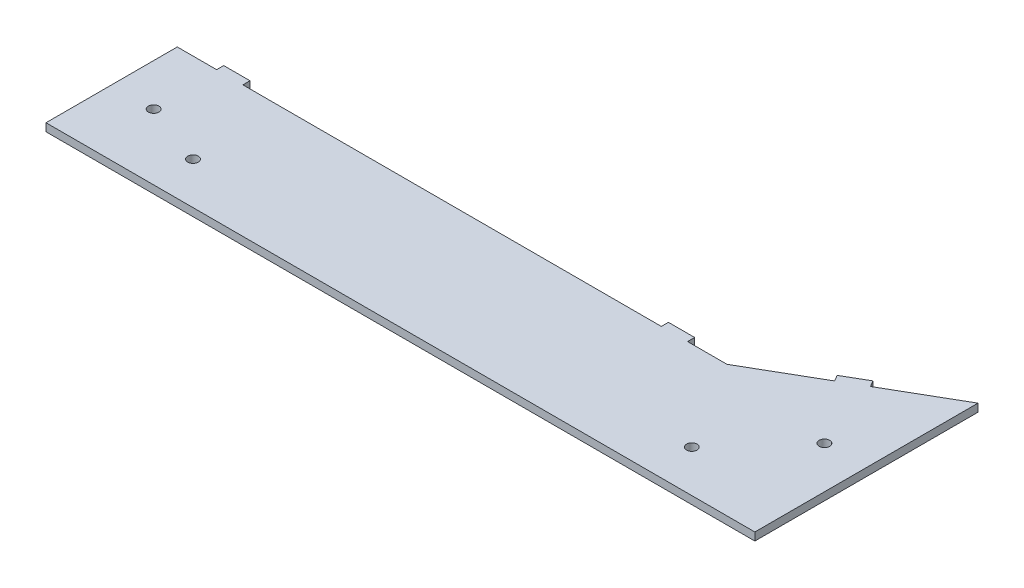
ISO-10303-21;
HEADER;
FILE_DESCRIPTION(('STEP AP214'),'2;1');
FILE_NAME('part.step','',(''),(''),'','','');
FILE_SCHEMA(('AUTOMOTIVE_DESIGN { 1 0 10303 214 1 1 1 1 }'));
ENDSEC;
DATA;
#1=APPLICATION_CONTEXT('core data for automotive mechanical design processes');
#2=APPLICATION_PROTOCOL_DEFINITION('international standard','automotive_design',2000,#1);
#3=PRODUCT_CONTEXT('',#1,'mechanical');
#4=PRODUCT('Part','Part','',(#3));
#5=PRODUCT_RELATED_PRODUCT_CATEGORY('part','',(#4));
#6=PRODUCT_DEFINITION_FORMATION('','',#4);
#7=PRODUCT_DEFINITION_CONTEXT('part definition',#1,'design');
#8=PRODUCT_DEFINITION('design','',#6,#7);
#9=PRODUCT_DEFINITION_SHAPE('','',#8);
#10=(LENGTH_UNIT() NAMED_UNIT(*) SI_UNIT(.MILLI.,.METRE.));
#11=(NAMED_UNIT(*) PLANE_ANGLE_UNIT() SI_UNIT($,.RADIAN.));
#12=(NAMED_UNIT(*) SI_UNIT($,.STERADIAN.) SOLID_ANGLE_UNIT());
#13=UNCERTAINTY_MEASURE_WITH_UNIT(LENGTH_MEASURE(1.E-05),#10,'distance_accuracy_value','');
#14=(GEOMETRIC_REPRESENTATION_CONTEXT(3) GLOBAL_UNCERTAINTY_ASSIGNED_CONTEXT((#13)) GLOBAL_UNIT_ASSIGNED_CONTEXT((#10,
#11,#12)) REPRESENTATION_CONTEXT('',''));
#15=CARTESIAN_POINT('',(0.,0.,0.));
#16=DIRECTION('',(0.,0.,1.));
#17=DIRECTION('',(1.,0.,0.));
#18=AXIS2_PLACEMENT_3D('',#15,#16,#17);
#19=CARTESIAN_POINT('',(101.124303581852,3.,-66.2732771144719));
#20=DIRECTION('',(0.500000000000001,0.,0.866025403784438));
#21=DIRECTION('',(0.866025403784438,0.,-0.500000000000001));
#22=AXIS2_PLACEMENT_3D('',#19,#20,#21);
#23=PLANE('',#22);
#24=DIRECTION('',(0.,-1.,0.));
#25=VECTOR('',#24,1.);
#26=CARTESIAN_POINT('',(75.1435414683194,3.,-51.2732771144718));
#27=LINE('',#26,#25);
#28=CARTESIAN_POINT('',(75.1435414683194,3.,-51.2732771144718));
#29=VERTEX_POINT('',#28);
#30=CARTESIAN_POINT('',(75.1435414683194,0.,-51.2732771144718));
#31=VERTEX_POINT('',#30);
#32=EDGE_CURVE('E55',#29,#31,#27,.T.);
#33=ORIENTED_EDGE('',*,*,#32,.F.);
#34=DIRECTION('',(-0.866025403784438,0.,0.500000000000001));
#35=VECTOR('',#34,1.);
#36=CARTESIAN_POINT('',(101.124303581852,3.,-66.2732771144719));
#37=LINE('',#36,#35);
#38=CARTESIAN_POINT('',(101.124303581852,3.,-66.2732771144719));
#39=VERTEX_POINT('',#38);
#40=EDGE_CURVE('E265',#39,#29,#37,.T.);
#41=ORIENTED_EDGE('',*,*,#40,.F.);
#42=DIRECTION('',(0.,-1.,0.));
#43=VECTOR('',#42,1.);
#44=CARTESIAN_POINT('',(101.124303581852,3.,-66.2732771144719));
#45=LINE('',#44,#43);
#46=CARTESIAN_POINT('',(101.124303581852,0.,-66.2732771144719));
#47=VERTEX_POINT('',#46);
#48=EDGE_CURVE('E280',#39,#47,#45,.T.);
#49=ORIENTED_EDGE('',*,*,#48,.T.);
#50=DIRECTION('',(-0.866025403784438,0.,0.500000000000001));
#51=VECTOR('',#50,1.);
#52=CARTESIAN_POINT('',(101.124303581852,0.,-66.2732771144719));
#53=LINE('',#52,#51);
#54=EDGE_CURVE('E281',#47,#31,#53,.T.);
#55=ORIENTED_EDGE('',*,*,#54,.T.);
#56=EDGE_LOOP('',(#33,#41,#49,#55));
#57=FACE_BOUND('',#56,.T.);
#58=ADVANCED_FACE('F33',(#57),#23,.F.);
#59=DIRECTION('',(0.,1.,0.));
#60=VECTOR('',#59,1.);
#61=CARTESIAN_POINT('',(66.483287430475,3.,-46.2732771144718));
#62=LINE('',#61,#60);
#63=CARTESIAN_POINT('',(66.483287430475,0.,-46.2732771144718));
#64=VERTEX_POINT('',#63);
#65=CARTESIAN_POINT('',(66.483287430475,3.,-46.2732771144718));
#66=VERTEX_POINT('',#65);
#67=EDGE_CURVE('E173',#64,#66,#62,.T.);
#68=ORIENTED_EDGE('',*,*,#67,.F.);
#69=CARTESIAN_POINT('',(40.5025253169418,0.,-31.2732771144718));
#70=VERTEX_POINT('',#69);
#71=EDGE_CURVE('E264',#64,#70,#53,.T.);
#72=ORIENTED_EDGE('',*,*,#71,.T.);
#73=DIRECTION('',(0.,-1.,0.));
#74=VECTOR('',#73,1.);
#75=CARTESIAN_POINT('',(40.5025253169418,3.,-31.2732771144718));
#76=LINE('',#75,#74);
#77=CARTESIAN_POINT('',(40.5025253169418,3.,-31.2732771144718));
#78=VERTEX_POINT('',#77);
#79=EDGE_CURVE('E11',#78,#70,#76,.T.);
#80=ORIENTED_EDGE('',*,*,#79,.F.);
#81=EDGE_CURVE('E47',#66,#78,#37,.T.);
#82=ORIENTED_EDGE('',*,*,#81,.F.);
#83=EDGE_LOOP('',(#68,#72,#80,#82));
#84=FACE_BOUND('',#83,.T.);
#85=ADVANCED_FACE('F332',(#84),#23,.F.);
#86=CARTESIAN_POINT('',(40.5025253169418,3.,-31.2732771144718));
#87=DIRECTION('',(0.,0.,1.));
#88=DIRECTION('',(1.,0.,0.));
#89=AXIS2_PLACEMENT_3D('',#86,#87,#88);
#90=PLANE('',#89);
#91=DIRECTION('',(-1.,0.,0.));
#92=VECTOR('',#91,1.);
#93=CARTESIAN_POINT('',(40.5025253169418,0.,-31.2732771144718));
#94=LINE('',#93,#92);
#95=CARTESIAN_POINT('',(25.5025253169418,0.,-31.2732771144718));
#96=VERTEX_POINT('',#95);
#97=EDGE_CURVE('E284',#70,#96,#94,.T.);
#98=ORIENTED_EDGE('',*,*,#97,.T.);
#99=DIRECTION('',(0.,1.,0.));
#100=VECTOR('',#99,1.);
#101=CARTESIAN_POINT('',(25.5025253169418,3.,-31.2732771144718));
#102=LINE('',#101,#100);
#103=CARTESIAN_POINT('',(25.5025253169418,3.,-31.2732771144718));
#104=VERTEX_POINT('',#103);
#105=EDGE_CURVE('E176',#96,#104,#102,.T.);
#106=ORIENTED_EDGE('',*,*,#105,.T.);
#107=DIRECTION('',(-1.,0.,0.));
#108=VECTOR('',#107,1.);
#109=CARTESIAN_POINT('',(40.5025253169418,3.,-31.2732771144718));
#110=LINE('',#109,#108);
#111=EDGE_CURVE('E268',#78,#104,#110,.T.);
#112=ORIENTED_EDGE('',*,*,#111,.F.);
#113=ORIENTED_EDGE('',*,*,#79,.T.);
#114=EDGE_LOOP('',(#98,#106,#112,#113));
#115=FACE_BOUND('',#114,.T.);
#116=ADVANCED_FACE('F330',(#115),#90,.F.);
#117=CARTESIAN_POINT('',(15.5025253169418,3.,-31.2732771144718));
#118=VERTEX_POINT('',#117);
#119=CARTESIAN_POINT('',(-143.875696418148,3.,-31.2732771144717));
#120=VERTEX_POINT('',#119);
#121=EDGE_CURVE('E272',#118,#120,#110,.T.);
#122=ORIENTED_EDGE('',*,*,#121,.F.);
#123=DIRECTION('',(0.,-1.,0.));
#124=VECTOR('',#123,1.);
#125=CARTESIAN_POINT('',(15.5025253169418,3.,-31.2732771144718));
#126=LINE('',#125,#124);
#127=CARTESIAN_POINT('',(15.5025253169418,0.,-31.2732771144718));
#128=VERTEX_POINT('',#127);
#129=EDGE_CURVE('E178',#118,#128,#126,.T.);
#130=ORIENTED_EDGE('',*,*,#129,.T.);
#131=CARTESIAN_POINT('',(-143.875696418148,0.,-31.2732771144717));
#132=VERTEX_POINT('',#131);
#133=EDGE_CURVE('E287',#128,#132,#94,.T.);
#134=ORIENTED_EDGE('',*,*,#133,.T.);
#135=DIRECTION('',(0.,1.,0.));
#136=VECTOR('',#135,1.);
#137=CARTESIAN_POINT('',(-143.875696418148,3.,-31.2732771144718));
#138=LINE('',#137,#136);
#139=EDGE_CURVE('E202',#132,#120,#138,.T.);
#140=ORIENTED_EDGE('',*,*,#139,.T.);
#141=EDGE_LOOP('',(#122,#130,#134,#140));
#142=FACE_BOUND('',#141,.T.);
#143=ADVANCED_FACE('F348',(#142),#90,.F.);
#144=CARTESIAN_POINT('',(-153.875696418148,3.,-31.2732771144717));
#145=VERTEX_POINT('',#144);
#146=CARTESIAN_POINT('',(-168.875696418148,3.,-31.2732771144717));
#147=VERTEX_POINT('',#146);
#148=EDGE_CURVE('E267',#145,#147,#110,.T.);
#149=ORIENTED_EDGE('',*,*,#148,.F.);
#150=DIRECTION('',(0.,-1.,0.));
#151=VECTOR('',#150,1.);
#152=CARTESIAN_POINT('',(-153.875696418148,3.,-31.2732771144718));
#153=LINE('',#152,#151);
#154=CARTESIAN_POINT('',(-153.875696418148,0.,-31.2732771144718));
#155=VERTEX_POINT('',#154);
#156=EDGE_CURVE('E215',#145,#155,#153,.T.);
#157=ORIENTED_EDGE('',*,*,#156,.T.);
#158=CARTESIAN_POINT('',(-168.875696418148,0.,-31.2732771144717));
#159=VERTEX_POINT('',#158);
#160=EDGE_CURVE('E283',#155,#159,#94,.T.);
#161=ORIENTED_EDGE('',*,*,#160,.T.);
#162=DIRECTION('',(0.,-1.,0.));
#163=VECTOR('',#162,1.);
#164=CARTESIAN_POINT('',(-168.875696418148,3.,-31.2732771144717));
#165=LINE('',#164,#163);
#166=EDGE_CURVE('E40',#147,#159,#165,.T.);
#167=ORIENTED_EDGE('',*,*,#166,.F.);
#168=EDGE_LOOP('',(#149,#157,#161,#167));
#169=FACE_BOUND('',#168,.T.);
#170=ADVANCED_FACE('F359',(#169),#90,.F.);
#171=CARTESIAN_POINT('',(-168.875696418148,3.,-31.2732771144717));
#172=DIRECTION('',(1.,0.,0.));
#173=DIRECTION('',(0.,0.,-1.));
#174=AXIS2_PLACEMENT_3D('',#171,#172,#173);
#175=PLANE('',#174);
#176=DIRECTION('',(0.,0.,1.));
#177=VECTOR('',#176,1.);
#178=CARTESIAN_POINT('',(-168.875696418148,0.,-31.2732771144717));
#179=LINE('',#178,#177);
#180=CARTESIAN_POINT('',(-168.875696418148,0.,18.7267228855283));
#181=VERTEX_POINT('',#180);
#182=EDGE_CURVE('E286',#159,#181,#179,.T.);
#183=ORIENTED_EDGE('',*,*,#182,.T.);
#184=DIRECTION('',(0.,-1.,0.));
#185=VECTOR('',#184,1.);
#186=CARTESIAN_POINT('',(-168.875696418148,3.,18.7267228855283));
#187=LINE('',#186,#185);
#188=CARTESIAN_POINT('',(-168.875696418148,3.,18.7267228855283));
#189=VERTEX_POINT('',#188);
#190=EDGE_CURVE('E300',#189,#181,#187,.T.);
#191=ORIENTED_EDGE('',*,*,#190,.F.);
#192=DIRECTION('',(0.,0.,1.));
#193=VECTOR('',#192,1.);
#194=CARTESIAN_POINT('',(-168.875696418148,3.,-31.2732771144717));
#195=LINE('',#194,#193);
#196=EDGE_CURVE('E271',#147,#189,#195,.T.);
#197=ORIENTED_EDGE('',*,*,#196,.F.);
#198=ORIENTED_EDGE('',*,*,#166,.T.);
#199=EDGE_LOOP('',(#183,#191,#197,#198));
#200=FACE_BOUND('',#199,.T.);
#201=ADVANCED_FACE('F306',(#200),#175,.F.);
#202=CARTESIAN_POINT('',(101.124303581852,3.,18.7267228855282));
#203=DIRECTION('',(0.,0.,1.));
#204=DIRECTION('',(1.,0.,0.));
#205=AXIS2_PLACEMENT_3D('',#202,#203,#204);
#206=PLANE('',#205);
#207=DIRECTION('',(-1.,0.,0.));
#208=VECTOR('',#207,1.);
#209=CARTESIAN_POINT('',(101.124303581852,0.,18.7267228855282));
#210=LINE('',#209,#208);
#211=CARTESIAN_POINT('',(101.124303581852,0.,18.7267228855282));
#212=VERTEX_POINT('',#211);
#213=EDGE_CURVE('E290',#212,#181,#210,.T.);
#214=ORIENTED_EDGE('',*,*,#213,.F.);
#215=DIRECTION('',(0.,-1.,0.));
#216=VECTOR('',#215,1.);
#217=CARTESIAN_POINT('',(101.124303581852,3.,18.7267228855282));
#218=LINE('',#217,#216);
#219=CARTESIAN_POINT('',(101.124303581852,3.,18.7267228855282));
#220=VERTEX_POINT('',#219);
#221=EDGE_CURVE('E297',#220,#212,#218,.T.);
#222=ORIENTED_EDGE('',*,*,#221,.F.);
#223=DIRECTION('',(-1.,0.,0.));
#224=VECTOR('',#223,1.);
#225=CARTESIAN_POINT('',(101.124303581852,3.,18.7267228855282));
#226=LINE('',#225,#224);
#227=EDGE_CURVE('E274',#220,#189,#226,.T.);
#228=ORIENTED_EDGE('',*,*,#227,.T.);
#229=ORIENTED_EDGE('',*,*,#190,.T.);
#230=EDGE_LOOP('',(#214,#222,#228,#229));
#231=FACE_BOUND('',#230,.T.);
#232=ADVANCED_FACE('F311',(#231),#206,.T.);
#233=CARTESIAN_POINT('',(101.124303581852,3.,-11.2137320546137));
#234=DIRECTION('',(-1.,0.,0.));
#235=DIRECTION('',(0.,0.,1.));
#236=AXIS2_PLACEMENT_3D('',#233,#234,#235);
#237=PLANE('',#236);
#238=DIRECTION('',(0.,0.,-1.));
#239=VECTOR('',#238,1.);
#240=CARTESIAN_POINT('',(101.124303581852,0.,-11.2137320546137));
#241=LINE('',#240,#239);
#242=EDGE_CURVE('E293',#212,#47,#241,.T.);
#243=ORIENTED_EDGE('',*,*,#242,.T.);
#244=ORIENTED_EDGE('',*,*,#48,.F.);
#245=DIRECTION('',(0.,0.,1.));
#246=VECTOR('',#245,1.);
#247=CARTESIAN_POINT('',(101.124303581852,3.,-11.2137320546137));
#248=LINE('',#247,#246);
#249=EDGE_CURVE('E277',#39,#220,#248,.T.);
#250=ORIENTED_EDGE('',*,*,#249,.T.);
#251=ORIENTED_EDGE('',*,*,#221,.T.);
#252=EDGE_LOOP('',(#243,#244,#250,#251));
#253=FACE_BOUND('',#252,.T.);
#254=ADVANCED_FACE('F317',(#253),#237,.F.);
#255=CARTESIAN_POINT('',(0.,3.,0.));
#256=DIRECTION('',(0.,1.,0.));
#257=DIRECTION('',(0.,0.,1.));
#258=AXIS2_PLACEMENT_3D('',#255,#256,#257);
#259=PLANE('',#258);
#260=CARTESIAN_POINT('',(61.1243035818525,3.,2.7267228855282));
#261=DIRECTION('',(0.,1.,0.));
#262=DIRECTION('',(0.,0.,1.));
#263=AXIS2_PLACEMENT_3D('',#260,#261,#262);
#264=CIRCLE('',#263,1.99999999999999);
#265=CARTESIAN_POINT('',(61.1243035818525,3.,4.72672288552819));
#266=VERTEX_POINT('',#265);
#267=EDGE_CURVE('E232',#266,#266,#264,.T.);
#268=ORIENTED_EDGE('',*,*,#267,.F.);
#269=EDGE_LOOP('',(#268));
#270=FACE_BOUND('',#269,.T.);
#271=CARTESIAN_POINT('',(-128.875696418148,3.,2.7267228855282));
#272=DIRECTION('',(0.,1.,0.));
#273=DIRECTION('',(0.,0.,1.));
#274=AXIS2_PLACEMENT_3D('',#271,#272,#273);
#275=CIRCLE('',#274,2.);
#276=CARTESIAN_POINT('',(-128.875696418148,3.,4.7267228855282));
#277=VERTEX_POINT('',#276);
#278=EDGE_CURVE('E246',#277,#277,#275,.T.);
#279=ORIENTED_EDGE('',*,*,#278,.F.);
#280=EDGE_LOOP('',(#279));
#281=FACE_BOUND('',#280,.T.);
#282=CARTESIAN_POINT('',(85.1243035818525,3.,-23.7732771144718));
#283=DIRECTION('',(0.,1.,0.));
#284=DIRECTION('',(0.,0.,1.));
#285=AXIS2_PLACEMENT_3D('',#282,#283,#284);
#286=CIRCLE('',#285,2.);
#287=CARTESIAN_POINT('',(85.1243035818525,3.,-21.7732771144718));
#288=VERTEX_POINT('',#287);
#289=EDGE_CURVE('E255',#288,#288,#286,.T.);
#290=ORIENTED_EDGE('',*,*,#289,.F.);
#291=EDGE_LOOP('',(#290));
#292=FACE_BOUND('',#291,.T.);
#293=CARTESIAN_POINT('',(-152.875696418148,3.,-6.27327711447171));
#294=DIRECTION('',(0.,1.,0.));
#295=DIRECTION('',(0.,0.,1.));
#296=AXIS2_PLACEMENT_3D('',#293,#294,#295);
#297=CIRCLE('',#296,2.);
#298=CARTESIAN_POINT('',(-152.875696418148,3.,-4.27327711447172));
#299=VERTEX_POINT('',#298);
#300=EDGE_CURVE('E258',#299,#299,#297,.T.);
#301=ORIENTED_EDGE('',*,*,#300,.F.);
#302=EDGE_LOOP('',(#301));
#303=FACE_BOUND('',#302,.T.);
#304=ORIENTED_EDGE('',*,*,#40,.T.);
#305=DIRECTION('',(0.500000000000001,0.,0.866025403784438));
#306=VECTOR('',#305,1.);
#307=CARTESIAN_POINT('',(73.7935414683194,3.,-53.6115457046898));
#308=LINE('',#307,#306);
#309=CARTESIAN_POINT('',(73.7935414683194,3.,-53.6115457046898));
#310=VERTEX_POINT('',#309);
#311=EDGE_CURVE('E318',#310,#29,#308,.T.);
#312=ORIENTED_EDGE('',*,*,#311,.F.);
#313=DIRECTION('',(0.866025403784439,0.,-0.5));
#314=VECTOR('',#313,1.);
#315=CARTESIAN_POINT('',(73.7935414683194,3.,-53.6115457046898));
#316=LINE('',#315,#314);
#317=CARTESIAN_POINT('',(65.133287430475,3.,-48.6115457046898));
#318=VERTEX_POINT('',#317);
#319=EDGE_CURVE('E169',#318,#310,#316,.T.);
#320=ORIENTED_EDGE('',*,*,#319,.F.);
#321=DIRECTION('',(0.500000000000001,0.,0.866025403784438));
#322=VECTOR('',#321,1.);
#323=CARTESIAN_POINT('',(65.133287430475,3.,-48.6115457046898));
#324=LINE('',#323,#322);
#325=EDGE_CURVE('E180',#318,#66,#324,.T.);
#326=ORIENTED_EDGE('',*,*,#325,.T.);
#327=ORIENTED_EDGE('',*,*,#81,.T.);
#328=ORIENTED_EDGE('',*,*,#111,.T.);
#329=DIRECTION('',(0.,0.,1.));
#330=VECTOR('',#329,1.);
#331=CARTESIAN_POINT('',(25.5025253169418,3.,-33.9732771144718));
#332=LINE('',#331,#330);
#333=CARTESIAN_POINT('',(25.5025253169418,3.,-33.9732771144718));
#334=VERTEX_POINT('',#333);
#335=EDGE_CURVE('E195',#334,#104,#332,.T.);
#336=ORIENTED_EDGE('',*,*,#335,.F.);
#337=DIRECTION('',(-1.,0.,0.));
#338=VECTOR('',#337,1.);
#339=CARTESIAN_POINT('',(25.5025253169418,3.,-33.9732771144718));
#340=LINE('',#339,#338);
#341=CARTESIAN_POINT('',(15.5025253169418,3.,-33.9732771144718));
#342=VERTEX_POINT('',#341);
#343=EDGE_CURVE('E187',#334,#342,#340,.T.);
#344=ORIENTED_EDGE('',*,*,#343,.T.);
#345=DIRECTION('',(0.,0.,1.));
#346=VECTOR('',#345,1.);
#347=CARTESIAN_POINT('',(15.5025253169418,3.,-33.9732771144718));
#348=LINE('',#347,#346);
#349=EDGE_CURVE('E206',#342,#118,#348,.T.);
#350=ORIENTED_EDGE('',*,*,#349,.T.);
#351=ORIENTED_EDGE('',*,*,#121,.T.);
#352=DIRECTION('',(0.,0.,1.));
#353=VECTOR('',#352,1.);
#354=CARTESIAN_POINT('',(-143.875696418148,3.,-33.9732771144718));
#355=LINE('',#354,#353);
#356=CARTESIAN_POINT('',(-143.875696418148,3.,-33.9732771144718));
#357=VERTEX_POINT('',#356);
#358=EDGE_CURVE('E224',#357,#120,#355,.T.);
#359=ORIENTED_EDGE('',*,*,#358,.F.);
#360=DIRECTION('',(-1.,0.,0.));
#361=VECTOR('',#360,1.);
#362=CARTESIAN_POINT('',(-143.875696418148,3.,-33.9732771144718));
#363=LINE('',#362,#361);
#364=CARTESIAN_POINT('',(-153.875696418148,3.,-33.9732771144718));
#365=VERTEX_POINT('',#364);
#366=EDGE_CURVE('E214',#357,#365,#363,.T.);
#367=ORIENTED_EDGE('',*,*,#366,.T.);
#368=DIRECTION('',(0.,0.,1.));
#369=VECTOR('',#368,1.);
#370=CARTESIAN_POINT('',(-153.875696418148,3.,-33.9732771144718));
#371=LINE('',#370,#369);
#372=EDGE_CURVE('E236',#365,#145,#371,.T.);
#373=ORIENTED_EDGE('',*,*,#372,.T.);
#374=ORIENTED_EDGE('',*,*,#148,.T.);
#375=ORIENTED_EDGE('',*,*,#196,.T.);
#376=ORIENTED_EDGE('',*,*,#227,.F.);
#377=ORIENTED_EDGE('',*,*,#249,.F.);
#378=EDGE_LOOP('',(#304,#312,#320,#326,#327,#328,#336,#344,#350,#351,#359,#367,#373,#374,#375,
#376,#377));
#379=FACE_BOUND('',#378,.T.);
#380=ADVANCED_FACE('F314',(#270,#281,#292,#303,#379),#259,.T.);
#381=CARTESIAN_POINT('',(0.,0.,0.));
#382=DIRECTION('',(0.,1.,0.));
#383=DIRECTION('',(0.,0.,1.));
#384=AXIS2_PLACEMENT_3D('',#381,#382,#383);
#385=PLANE('',#384);
#386=CARTESIAN_POINT('',(61.1243035818525,0.,2.7267228855282));
#387=DIRECTION('',(0.,1.,0.));
#388=DIRECTION('',(0.,0.,1.));
#389=AXIS2_PLACEMENT_3D('',#386,#387,#388);
#390=CIRCLE('',#389,1.99999999999999);
#391=CARTESIAN_POINT('',(61.1243035818525,0.,4.72672288552819));
#392=VERTEX_POINT('',#391);
#393=EDGE_CURVE('E243',#392,#392,#390,.F.);
#394=ORIENTED_EDGE('',*,*,#393,.F.);
#395=EDGE_LOOP('',(#394));
#396=FACE_BOUND('',#395,.T.);
#397=CARTESIAN_POINT('',(-128.875696418148,0.,2.7267228855282));
#398=DIRECTION('',(0.,1.,0.));
#399=DIRECTION('',(0.,0.,1.));
#400=AXIS2_PLACEMENT_3D('',#397,#398,#399);
#401=CIRCLE('',#400,2.);
#402=CARTESIAN_POINT('',(-128.875696418148,0.,4.7267228855282));
#403=VERTEX_POINT('',#402);
#404=EDGE_CURVE('E249',#403,#403,#401,.F.);
#405=ORIENTED_EDGE('',*,*,#404,.F.);
#406=EDGE_LOOP('',(#405));
#407=FACE_BOUND('',#406,.T.);
#408=CARTESIAN_POINT('',(85.1243035818525,0.,-23.7732771144718));
#409=DIRECTION('',(0.,1.,0.));
#410=DIRECTION('',(0.,0.,1.));
#411=AXIS2_PLACEMENT_3D('',#408,#409,#410);
#412=CIRCLE('',#411,2.);
#413=CARTESIAN_POINT('',(85.1243035818525,0.,-21.7732771144718));
#414=VERTEX_POINT('',#413);
#415=EDGE_CURVE('E252',#414,#414,#412,.F.);
#416=ORIENTED_EDGE('',*,*,#415,.F.);
#417=EDGE_LOOP('',(#416));
#418=FACE_BOUND('',#417,.T.);
#419=CARTESIAN_POINT('',(-152.875696418148,0.,-6.27327711447171));
#420=DIRECTION('',(0.,1.,0.));
#421=DIRECTION('',(0.,0.,1.));
#422=AXIS2_PLACEMENT_3D('',#419,#420,#421);
#423=CIRCLE('',#422,2.);
#424=CARTESIAN_POINT('',(-152.875696418148,0.,-4.27327711447172));
#425=VERTEX_POINT('',#424);
#426=EDGE_CURVE('E261',#425,#425,#423,.F.);
#427=ORIENTED_EDGE('',*,*,#426,.F.);
#428=EDGE_LOOP('',(#427));
#429=FACE_BOUND('',#428,.T.);
#430=ORIENTED_EDGE('',*,*,#54,.F.);
#431=ORIENTED_EDGE('',*,*,#242,.F.);
#432=ORIENTED_EDGE('',*,*,#213,.T.);
#433=ORIENTED_EDGE('',*,*,#182,.F.);
#434=ORIENTED_EDGE('',*,*,#160,.F.);
#435=DIRECTION('',(0.,0.,1.));
#436=VECTOR('',#435,1.);
#437=CARTESIAN_POINT('',(-153.875696418148,0.,-33.9732771144718));
#438=LINE('',#437,#436);
#439=CARTESIAN_POINT('',(-153.875696418148,0.,-33.9732771144718));
#440=VERTEX_POINT('',#439);
#441=EDGE_CURVE('E233',#440,#155,#438,.T.);
#442=ORIENTED_EDGE('',*,*,#441,.F.);
#443=DIRECTION('',(1.,0.,0.));
#444=VECTOR('',#443,1.);
#445=CARTESIAN_POINT('',(-143.875696418148,0.,-33.9732771144718));
#446=LINE('',#445,#444);
#447=CARTESIAN_POINT('',(-143.875696418148,0.,-33.9732771144718));
#448=VERTEX_POINT('',#447);
#449=EDGE_CURVE('E221',#440,#448,#446,.T.);
#450=ORIENTED_EDGE('',*,*,#449,.T.);
#451=DIRECTION('',(0.,0.,1.));
#452=VECTOR('',#451,1.);
#453=CARTESIAN_POINT('',(-143.875696418148,0.,-33.9732771144718));
#454=LINE('',#453,#452);
#455=EDGE_CURVE('E229',#448,#132,#454,.T.);
#456=ORIENTED_EDGE('',*,*,#455,.T.);
#457=ORIENTED_EDGE('',*,*,#133,.F.);
#458=DIRECTION('',(0.,0.,1.));
#459=VECTOR('',#458,1.);
#460=CARTESIAN_POINT('',(15.5025253169418,0.,-33.9732771144718));
#461=LINE('',#460,#459);
#462=CARTESIAN_POINT('',(15.5025253169418,0.,-33.9732771144718));
#463=VERTEX_POINT('',#462);
#464=EDGE_CURVE('E203',#463,#128,#461,.T.);
#465=ORIENTED_EDGE('',*,*,#464,.F.);
#466=DIRECTION('',(1.,0.,0.));
#467=VECTOR('',#466,1.);
#468=CARTESIAN_POINT('',(25.5025253169418,0.,-33.9732771144718));
#469=LINE('',#468,#467);
#470=CARTESIAN_POINT('',(25.5025253169418,0.,-33.9732771144718));
#471=VERTEX_POINT('',#470);
#472=EDGE_CURVE('E193',#463,#471,#469,.T.);
#473=ORIENTED_EDGE('',*,*,#472,.T.);
#474=DIRECTION('',(0.,0.,1.));
#475=VECTOR('',#474,1.);
#476=CARTESIAN_POINT('',(25.5025253169418,0.,-33.9732771144718));
#477=LINE('',#476,#475);
#478=EDGE_CURVE('E199',#471,#96,#477,.T.);
#479=ORIENTED_EDGE('',*,*,#478,.T.);
#480=ORIENTED_EDGE('',*,*,#97,.F.);
#481=ORIENTED_EDGE('',*,*,#71,.F.);
#482=DIRECTION('',(0.500000000000001,0.,0.866025403784438));
#483=VECTOR('',#482,1.);
#484=CARTESIAN_POINT('',(65.133287430475,0.,-48.6115457046898));
#485=LINE('',#484,#483);
#486=CARTESIAN_POINT('',(65.133287430475,0.,-48.6115457046898));
#487=VERTEX_POINT('',#486);
#488=EDGE_CURVE('E160',#487,#64,#485,.T.);
#489=ORIENTED_EDGE('',*,*,#488,.F.);
#490=DIRECTION('',(-0.866025403784439,0.,0.5));
#491=VECTOR('',#490,1.);
#492=CARTESIAN_POINT('',(73.7935414683194,0.,-53.6115457046898));
#493=LINE('',#492,#491);
#494=CARTESIAN_POINT('',(73.7935414683194,0.,-53.6115457046898));
#495=VERTEX_POINT('',#494);
#496=EDGE_CURVE('E153',#495,#487,#493,.T.);
#497=ORIENTED_EDGE('',*,*,#496,.F.);
#498=DIRECTION('',(0.500000000000001,0.,0.866025403784438));
#499=VECTOR('',#498,1.);
#500=CARTESIAN_POINT('',(73.7935414683194,0.,-53.6115457046898));
#501=LINE('',#500,#499);
#502=EDGE_CURVE('E158',#495,#31,#501,.T.);
#503=ORIENTED_EDGE('',*,*,#502,.T.);
#504=EDGE_LOOP('',(#430,#431,#432,#433,#434,#442,#450,#456,#457,#465,#473,#479,#480,#481,#489,
#497,#503));
#505=FACE_BOUND('',#504,.T.);
#506=ADVANCED_FACE('F156',(#396,#407,#418,#429,#505),#385,.F.);
#507=CARTESIAN_POINT('',(-152.875696418148,-0.00100000000000013,-6.27327711447171));
#508=DIRECTION('',(0.,1.,0.));
#509=DIRECTION('',(0.,0.,1.));
#510=AXIS2_PLACEMENT_3D('',#507,#508,#509);
#511=CYLINDRICAL_SURFACE('',#510,2.);
#512=ORIENTED_EDGE('',*,*,#300,.T.);
#513=EDGE_LOOP('',(#512));
#514=FACE_BOUND('',#513,.T.);
#515=ORIENTED_EDGE('',*,*,#426,.T.);
#516=EDGE_LOOP('',(#515));
#517=FACE_BOUND('',#516,.T.);
#518=ADVANCED_FACE('F469',(#514,#517),#511,.F.);
#519=CARTESIAN_POINT('',(85.1243035818525,-0.00100000000000013,-23.7732771144718));
#520=DIRECTION('',(0.,1.,0.));
#521=DIRECTION('',(0.,0.,1.));
#522=AXIS2_PLACEMENT_3D('',#519,#520,#521);
#523=CYLINDRICAL_SURFACE('',#522,2.);
#524=ORIENTED_EDGE('',*,*,#289,.T.);
#525=EDGE_LOOP('',(#524));
#526=FACE_BOUND('',#525,.T.);
#527=ORIENTED_EDGE('',*,*,#415,.T.);
#528=EDGE_LOOP('',(#527));
#529=FACE_BOUND('',#528,.T.);
#530=ADVANCED_FACE('F503',(#526,#529),#523,.F.);
#531=CARTESIAN_POINT('',(-128.875696418148,-0.00100000000000013,2.7267228855282));
#532=DIRECTION('',(0.,1.,0.));
#533=DIRECTION('',(0.,0.,1.));
#534=AXIS2_PLACEMENT_3D('',#531,#532,#533);
#535=CYLINDRICAL_SURFACE('',#534,2.);
#536=ORIENTED_EDGE('',*,*,#278,.T.);
#537=EDGE_LOOP('',(#536));
#538=FACE_BOUND('',#537,.T.);
#539=ORIENTED_EDGE('',*,*,#404,.T.);
#540=EDGE_LOOP('',(#539));
#541=FACE_BOUND('',#540,.T.);
#542=ADVANCED_FACE('F499',(#538,#541),#535,.F.);
#543=CARTESIAN_POINT('',(61.1243035818525,-0.00100000000000013,2.7267228855282));
#544=DIRECTION('',(0.,1.,0.));
#545=DIRECTION('',(0.,0.,1.));
#546=AXIS2_PLACEMENT_3D('',#543,#544,#545);
#547=CYLINDRICAL_SURFACE('',#546,1.99999999999999);
#548=ORIENTED_EDGE('',*,*,#267,.T.);
#549=EDGE_LOOP('',(#548));
#550=FACE_BOUND('',#549,.T.);
#551=ORIENTED_EDGE('',*,*,#393,.T.);
#552=EDGE_LOOP('',(#551));
#553=FACE_BOUND('',#552,.T.);
#554=ADVANCED_FACE('F398',(#550,#553),#547,.F.);
#555=CARTESIAN_POINT('',(-143.875696418148,3.,-33.9732771144718));
#556=DIRECTION('',(1.,0.,0.));
#557=DIRECTION('',(0.,0.,-1.));
#558=AXIS2_PLACEMENT_3D('',#555,#556,#557);
#559=PLANE('',#558);
#560=ORIENTED_EDGE('',*,*,#139,.F.);
#561=ORIENTED_EDGE('',*,*,#455,.F.);
#562=DIRECTION('',(0.,1.,0.));
#563=VECTOR('',#562,1.);
#564=CARTESIAN_POINT('',(-143.875696418148,3.,-33.9732771144718));
#565=LINE('',#564,#563);
#566=EDGE_CURVE('E211',#448,#357,#565,.T.);
#567=ORIENTED_EDGE('',*,*,#566,.T.);
#568=ORIENTED_EDGE('',*,*,#358,.T.);
#569=EDGE_LOOP('',(#560,#561,#567,#568));
#570=FACE_BOUND('',#569,.T.);
#571=ADVANCED_FACE('F350',(#570),#559,.T.);
#572=CARTESIAN_POINT('',(-153.875696418148,3.,-33.9732771144718));
#573=DIRECTION('',(-1.,0.,0.));
#574=DIRECTION('',(0.,0.,1.));
#575=AXIS2_PLACEMENT_3D('',#572,#573,#574);
#576=PLANE('',#575);
#577=ORIENTED_EDGE('',*,*,#156,.F.);
#578=ORIENTED_EDGE('',*,*,#372,.F.);
#579=DIRECTION('',(0.,-1.,0.));
#580=VECTOR('',#579,1.);
#581=CARTESIAN_POINT('',(-153.875696418148,3.,-33.9732771144718));
#582=LINE('',#581,#580);
#583=EDGE_CURVE('E218',#365,#440,#582,.T.);
#584=ORIENTED_EDGE('',*,*,#583,.T.);
#585=ORIENTED_EDGE('',*,*,#441,.T.);
#586=EDGE_LOOP('',(#577,#578,#584,#585));
#587=FACE_BOUND('',#586,.T.);
#588=ADVANCED_FACE('F358',(#587),#576,.T.);
#589=CARTESIAN_POINT('',(0.,0.,-33.9732771144718));
#590=DIRECTION('',(0.,0.,-1.));
#591=DIRECTION('',(-1.,0.,0.));
#592=AXIS2_PLACEMENT_3D('',#589,#590,#591);
#593=PLANE('',#592);
#594=ORIENTED_EDGE('',*,*,#566,.F.);
#595=ORIENTED_EDGE('',*,*,#449,.F.);
#596=ORIENTED_EDGE('',*,*,#583,.F.);
#597=ORIENTED_EDGE('',*,*,#366,.F.);
#598=EDGE_LOOP('',(#594,#595,#596,#597));
#599=FACE_BOUND('',#598,.T.);
#600=ADVANCED_FACE('F354',(#599),#593,.T.);
#601=CARTESIAN_POINT('',(25.5025253169418,3.,-33.9732771144718));
#602=DIRECTION('',(1.,0.,0.));
#603=DIRECTION('',(0.,0.,-1.));
#604=AXIS2_PLACEMENT_3D('',#601,#602,#603);
#605=PLANE('',#604);
#606=ORIENTED_EDGE('',*,*,#105,.F.);
#607=ORIENTED_EDGE('',*,*,#478,.F.);
#608=DIRECTION('',(0.,1.,0.));
#609=VECTOR('',#608,1.);
#610=CARTESIAN_POINT('',(25.5025253169418,3.,-33.9732771144718));
#611=LINE('',#610,#609);
#612=EDGE_CURVE('E184',#471,#334,#611,.T.);
#613=ORIENTED_EDGE('',*,*,#612,.T.);
#614=ORIENTED_EDGE('',*,*,#335,.T.);
#615=EDGE_LOOP('',(#606,#607,#613,#614));
#616=FACE_BOUND('',#615,.T.);
#617=ADVANCED_FACE('F337',(#616),#605,.T.);
#618=CARTESIAN_POINT('',(15.5025253169418,3.,-33.9732771144718));
#619=DIRECTION('',(-1.,0.,0.));
#620=DIRECTION('',(0.,-1.,0.));
#621=AXIS2_PLACEMENT_3D('',#618,#619,#620);
#622=PLANE('',#621);
#623=ORIENTED_EDGE('',*,*,#129,.F.);
#624=ORIENTED_EDGE('',*,*,#349,.F.);
#625=DIRECTION('',(0.,-1.,0.));
#626=VECTOR('',#625,1.);
#627=CARTESIAN_POINT('',(15.5025253169418,3.,-33.9732771144718));
#628=LINE('',#627,#626);
#629=EDGE_CURVE('E190',#342,#463,#628,.T.);
#630=ORIENTED_EDGE('',*,*,#629,.T.);
#631=ORIENTED_EDGE('',*,*,#464,.T.);
#632=EDGE_LOOP('',(#623,#624,#630,#631));
#633=FACE_BOUND('',#632,.T.);
#634=ADVANCED_FACE('F344',(#633),#622,.T.);
#635=CARTESIAN_POINT('',(0.,0.,-33.9732771144718));
#636=DIRECTION('',(0.,0.,-1.));
#637=DIRECTION('',(-1.,0.,0.));
#638=AXIS2_PLACEMENT_3D('',#635,#636,#637);
#639=PLANE('',#638);
#640=ORIENTED_EDGE('',*,*,#612,.F.);
#641=ORIENTED_EDGE('',*,*,#472,.F.);
#642=ORIENTED_EDGE('',*,*,#629,.F.);
#643=ORIENTED_EDGE('',*,*,#343,.F.);
#644=EDGE_LOOP('',(#640,#641,#642,#643));
#645=FACE_BOUND('',#644,.T.);
#646=ADVANCED_FACE('F341',(#645),#639,.T.);
#647=CARTESIAN_POINT('',(73.7935414683194,3.,-53.6115457046898));
#648=DIRECTION('',(-0.866025403784438,0.,0.500000000000001));
#649=DIRECTION('',(0.500000000000001,0.,0.866025403784438));
#650=AXIS2_PLACEMENT_3D('',#647,#648,#649);
#651=PLANE('',#650);
#652=ORIENTED_EDGE('',*,*,#32,.T.);
#653=ORIENTED_EDGE('',*,*,#502,.F.);
#654=DIRECTION('',(0.,-1.,0.));
#655=VECTOR('',#654,1.);
#656=CARTESIAN_POINT('',(73.7935414683194,3.,-53.6115457046898));
#657=LINE('',#656,#655);
#658=EDGE_CURVE('E164',#310,#495,#657,.T.);
#659=ORIENTED_EDGE('',*,*,#658,.F.);
#660=ORIENTED_EDGE('',*,*,#311,.T.);
#661=EDGE_LOOP('',(#652,#653,#659,#660));
#662=FACE_BOUND('',#661,.T.);
#663=ADVANCED_FACE('F175',(#662),#651,.F.);
#664=CARTESIAN_POINT('',(65.133287430475,3.,-48.6115457046898));
#665=DIRECTION('',(0.866025403784438,0.,-0.500000000000001));
#666=DIRECTION('',(-0.500000000000001,0.,-0.866025403784438));
#667=AXIS2_PLACEMENT_3D('',#664,#665,#666);
#668=PLANE('',#667);
#669=ORIENTED_EDGE('',*,*,#67,.T.);
#670=ORIENTED_EDGE('',*,*,#325,.F.);
#671=DIRECTION('',(0.,1.,0.));
#672=VECTOR('',#671,1.);
#673=CARTESIAN_POINT('',(65.133287430475,3.,-48.6115457046898));
#674=LINE('',#673,#672);
#675=EDGE_CURVE('E163',#487,#318,#674,.T.);
#676=ORIENTED_EDGE('',*,*,#675,.F.);
#677=ORIENTED_EDGE('',*,*,#488,.T.);
#678=EDGE_LOOP('',(#669,#670,#676,#677));
#679=FACE_BOUND('',#678,.T.);
#680=ADVANCED_FACE('F327',(#679),#668,.F.);
#681=CARTESIAN_POINT('',(-4.76609489112607,0.,-8.2551185051248));
#682=DIRECTION('',(-0.5,0.,-0.866025403784439));
#683=DIRECTION('',(-0.866025403784439,0.,0.5));
#684=AXIS2_PLACEMENT_3D('',#681,#682,#683);
#685=PLANE('',#684);
#686=ORIENTED_EDGE('',*,*,#658,.T.);
#687=ORIENTED_EDGE('',*,*,#496,.T.);
#688=ORIENTED_EDGE('',*,*,#675,.T.);
#689=ORIENTED_EDGE('',*,*,#319,.T.);
#690=EDGE_LOOP('',(#686,#687,#688,#689));
#691=FACE_BOUND('',#690,.T.);
#692=ADVANCED_FACE('F167',(#691),#685,.T.);
#693=CLOSED_SHELL('',(#58,#85,#116,#143,#170,#201,#232,#254,#380,#506,#518,#530,#542,#554,#571,
#588,#600,#617,#634,#646,#663,#680,#692));
#694=MANIFOLD_SOLID_BREP('B2',#693);
#695=ADVANCED_BREP_SHAPE_REPRESENTATION('',(#18,#694),#14);
#696=SHAPE_DEFINITION_REPRESENTATION(#9,#695);
ENDSEC;
END-ISO-10303-21;
